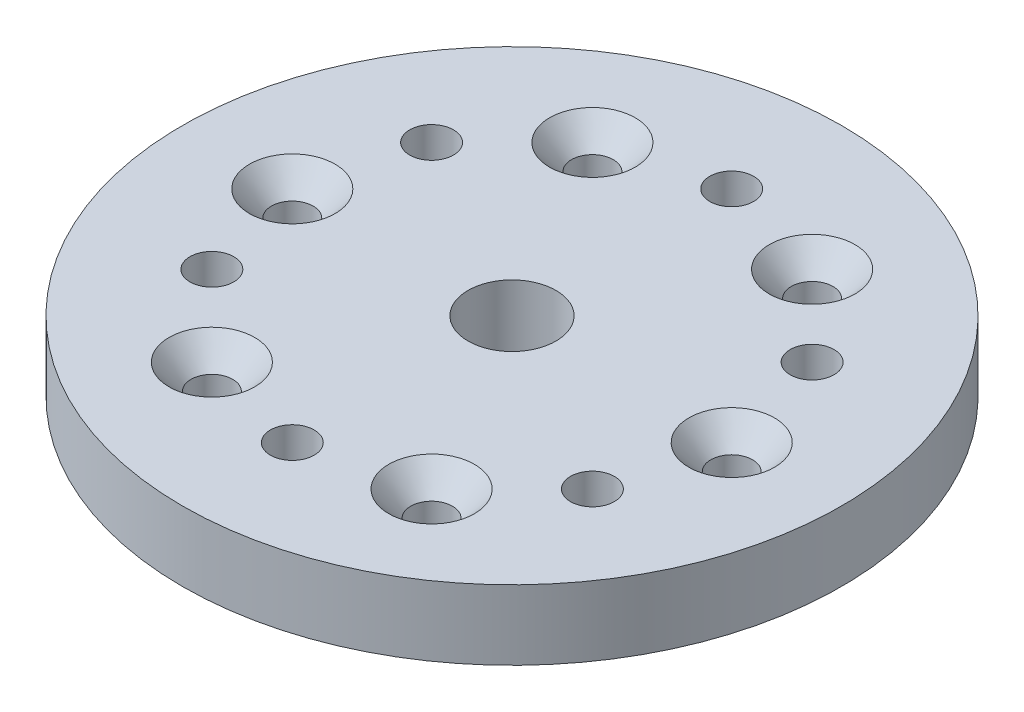
ISO-10303-21;
HEADER;
FILE_DESCRIPTION(('STEP AP214'),'2;1');
FILE_NAME('part.step','',(''),(''),'','','');
FILE_SCHEMA(('AUTOMOTIVE_DESIGN { 1 0 10303 214 1 1 1 1 }'));
ENDSEC;
DATA;
#1=APPLICATION_CONTEXT('core data for automotive mechanical design processes');
#2=APPLICATION_PROTOCOL_DEFINITION('international standard','automotive_design',2000,#1);
#3=PRODUCT_CONTEXT('',#1,'mechanical');
#4=PRODUCT('Part','Part','',(#3));
#5=PRODUCT_RELATED_PRODUCT_CATEGORY('part','',(#4));
#6=PRODUCT_DEFINITION_FORMATION('','',#4);
#7=PRODUCT_DEFINITION_CONTEXT('part definition',#1,'design');
#8=PRODUCT_DEFINITION('design','',#6,#7);
#9=PRODUCT_DEFINITION_SHAPE('','',#8);
#10=(LENGTH_UNIT() NAMED_UNIT(*) SI_UNIT(.MILLI.,.METRE.));
#11=(NAMED_UNIT(*) PLANE_ANGLE_UNIT() SI_UNIT($,.RADIAN.));
#12=(NAMED_UNIT(*) SI_UNIT($,.STERADIAN.) SOLID_ANGLE_UNIT());
#13=UNCERTAINTY_MEASURE_WITH_UNIT(LENGTH_MEASURE(1.E-05),#10,'distance_accuracy_value','');
#14=(GEOMETRIC_REPRESENTATION_CONTEXT(3) GLOBAL_UNCERTAINTY_ASSIGNED_CONTEXT((#13)) GLOBAL_UNIT_ASSIGNED_CONTEXT((#10,
#11,#12)) REPRESENTATION_CONTEXT('',''));
#15=CARTESIAN_POINT('',(0.,0.,0.));
#16=DIRECTION('',(0.,0.,1.));
#17=DIRECTION('',(1.,0.,0.));
#18=AXIS2_PLACEMENT_3D('',#15,#16,#17);
#19=CARTESIAN_POINT('',(0.,6.35,0.));
#20=DIRECTION('',(0.,1.,0.));
#21=DIRECTION('',(0.,0.,1.));
#22=AXIS2_PLACEMENT_3D('',#19,#20,#21);
#23=PLANE('',#22);
#24=CARTESIAN_POINT('',(-10.,6.35,-17.3205080756888));
#25=DIRECTION('',(0.,1.,0.));
#26=DIRECTION('',(0.,0.,1.));
#27=AXIS2_PLACEMENT_3D('',#24,#25,#26);
#28=CIRCLE('',#27,3.89890000002972);
#29=CARTESIAN_POINT('',(-10.,6.35,-13.4216080756591));
#30=VERTEX_POINT('',#29);
#31=EDGE_CURVE('E54',#30,#30,#28,.F.);
#32=ORIENTED_EDGE('',*,*,#31,.T.);
#33=EDGE_LOOP('',(#32));
#34=FACE_BOUND('',#33,.T.);
#35=CARTESIAN_POINT('',(-20.,6.35,0.));
#36=DIRECTION('',(0.,1.,0.));
#37=DIRECTION('',(0.,0.,1.));
#38=AXIS2_PLACEMENT_3D('',#35,#36,#37);
#39=CIRCLE('',#38,3.89890000002971);
#40=CARTESIAN_POINT('',(-20.,6.35,3.89890000002971));
#41=VERTEX_POINT('',#40);
#42=EDGE_CURVE('E57',#41,#41,#39,.F.);
#43=ORIENTED_EDGE('',*,*,#42,.T.);
#44=EDGE_LOOP('',(#43));
#45=FACE_BOUND('',#44,.T.);
#46=CARTESIAN_POINT('',(-10.,6.35,17.3205080756888));
#47=DIRECTION('',(0.,1.,0.));
#48=DIRECTION('',(0.,0.,1.));
#49=AXIS2_PLACEMENT_3D('',#46,#47,#48);
#50=CIRCLE('',#49,3.8989000000297);
#51=CARTESIAN_POINT('',(-10.,6.35,21.2194080757185));
#52=VERTEX_POINT('',#51);
#53=EDGE_CURVE('E60',#52,#52,#50,.F.);
#54=ORIENTED_EDGE('',*,*,#53,.T.);
#55=EDGE_LOOP('',(#54));
#56=FACE_BOUND('',#55,.T.);
#57=CARTESIAN_POINT('',(10.,6.35,17.3205080756888));
#58=DIRECTION('',(0.,1.,0.));
#59=DIRECTION('',(0.,0.,1.));
#60=AXIS2_PLACEMENT_3D('',#57,#58,#59);
#61=CIRCLE('',#60,3.8989000000297);
#62=CARTESIAN_POINT('',(10.,6.35,21.2194080757185));
#63=VERTEX_POINT('',#62);
#64=EDGE_CURVE('E63',#63,#63,#61,.F.);
#65=ORIENTED_EDGE('',*,*,#64,.T.);
#66=EDGE_LOOP('',(#65));
#67=FACE_BOUND('',#66,.T.);
#68=CARTESIAN_POINT('',(20.,6.35,0.));
#69=DIRECTION('',(0.,1.,0.));
#70=DIRECTION('',(0.,0.,1.));
#71=AXIS2_PLACEMENT_3D('',#68,#69,#70);
#72=CIRCLE('',#71,3.89890000002971);
#73=CARTESIAN_POINT('',(20.,6.35,3.89890000002971));
#74=VERTEX_POINT('',#73);
#75=EDGE_CURVE('E66',#74,#74,#72,.F.);
#76=ORIENTED_EDGE('',*,*,#75,.T.);
#77=EDGE_LOOP('',(#76));
#78=FACE_BOUND('',#77,.T.);
#79=CARTESIAN_POINT('',(10.,6.35,-17.3205080756888));
#80=DIRECTION('',(0.,1.,0.));
#81=DIRECTION('',(0.,0.,1.));
#82=AXIS2_PLACEMENT_3D('',#79,#80,#81);
#83=CIRCLE('',#82,3.89890000002972);
#84=CARTESIAN_POINT('',(10.,6.35,-13.4216080756591));
#85=VERTEX_POINT('',#84);
#86=EDGE_CURVE('E69',#85,#85,#83,.F.);
#87=ORIENTED_EDGE('',*,*,#86,.T.);
#88=EDGE_LOOP('',(#87));
#89=FACE_BOUND('',#88,.T.);
#90=CARTESIAN_POINT('',(-17.3205080756888,6.35,9.99999999999999));
#91=DIRECTION('',(0.,1.,0.));
#92=DIRECTION('',(0.,0.,1.));
#93=AXIS2_PLACEMENT_3D('',#90,#91,#92);
#94=CIRCLE('',#93,1.9939);
#95=CARTESIAN_POINT('',(-17.3205080756888,6.35,11.9939));
#96=VERTEX_POINT('',#95);
#97=EDGE_CURVE('E127',#96,#96,#94,.T.);
#98=ORIENTED_EDGE('',*,*,#97,.F.);
#99=EDGE_LOOP('',(#98));
#100=FACE_BOUND('',#99,.T.);
#101=CARTESIAN_POINT('',(17.3205080756888,6.35,10.));
#102=DIRECTION('',(0.,1.,0.));
#103=DIRECTION('',(0.,0.,1.));
#104=AXIS2_PLACEMENT_3D('',#101,#102,#103);
#105=CIRCLE('',#104,1.9939);
#106=CARTESIAN_POINT('',(17.3205080756888,6.35,11.9939));
#107=VERTEX_POINT('',#106);
#108=EDGE_CURVE('E115',#107,#107,#105,.T.);
#109=ORIENTED_EDGE('',*,*,#108,.F.);
#110=EDGE_LOOP('',(#109));
#111=FACE_BOUND('',#110,.T.);
#112=CARTESIAN_POINT('',(0.,6.35,0.));
#113=DIRECTION('',(0.,1.,0.));
#114=DIRECTION('',(0.,0.,1.));
#115=AXIS2_PLACEMENT_3D('',#112,#113,#114);
#116=CIRCLE('',#115,4.);
#117=CARTESIAN_POINT('',(0.,6.35,4.));
#118=VERTEX_POINT('',#117);
#119=EDGE_CURVE('E105',#118,#118,#116,.T.);
#120=ORIENTED_EDGE('',*,*,#119,.F.);
#121=EDGE_LOOP('',(#120));
#122=FACE_BOUND('',#121,.T.);
#123=CARTESIAN_POINT('',(0.,6.35,-20.));
#124=DIRECTION('',(0.,1.,0.));
#125=DIRECTION('',(0.,0.,1.));
#126=AXIS2_PLACEMENT_3D('',#123,#124,#125);
#127=CIRCLE('',#126,1.9939);
#128=CARTESIAN_POINT('',(0.,6.35,-18.0061));
#129=VERTEX_POINT('',#128);
#130=EDGE_CURVE('E84',#129,#129,#127,.T.);
#131=ORIENTED_EDGE('',*,*,#130,.F.);
#132=EDGE_LOOP('',(#131));
#133=FACE_BOUND('',#132,.T.);
#134=CARTESIAN_POINT('',(0.,6.35,0.));
#135=DIRECTION('',(0.,1.,0.));
#136=DIRECTION('',(0.,0.,1.));
#137=AXIS2_PLACEMENT_3D('',#134,#135,#136);
#138=CIRCLE('',#137,30.);
#139=CARTESIAN_POINT('',(0.,6.35,30.));
#140=VERTEX_POINT('',#139);
#141=EDGE_CURVE('E75',#140,#140,#138,.T.);
#142=ORIENTED_EDGE('',*,*,#141,.T.);
#143=EDGE_LOOP('',(#142));
#144=FACE_BOUND('',#143,.T.);
#145=CARTESIAN_POINT('',(17.3205080756888,6.35,-9.99999999999998));
#146=DIRECTION('',(0.,1.,0.));
#147=DIRECTION('',(0.,0.,1.));
#148=AXIS2_PLACEMENT_3D('',#145,#146,#147);
#149=CIRCLE('',#148,1.9939);
#150=CARTESIAN_POINT('',(17.3205080756888,6.35,-8.00609999999998));
#151=VERTEX_POINT('',#150);
#152=EDGE_CURVE('E109',#151,#151,#149,.T.);
#153=ORIENTED_EDGE('',*,*,#152,.F.);
#154=EDGE_LOOP('',(#153));
#155=FACE_BOUND('',#154,.T.);
#156=CARTESIAN_POINT('',(0.,6.35,20.));
#157=DIRECTION('',(0.,1.,0.));
#158=DIRECTION('',(0.,0.,1.));
#159=AXIS2_PLACEMENT_3D('',#156,#157,#158);
#160=CIRCLE('',#159,1.9939);
#161=CARTESIAN_POINT('',(0.,6.35,21.9939));
#162=VERTEX_POINT('',#161);
#163=EDGE_CURVE('E121',#162,#162,#160,.T.);
#164=ORIENTED_EDGE('',*,*,#163,.F.);
#165=EDGE_LOOP('',(#164));
#166=FACE_BOUND('',#165,.T.);
#167=CARTESIAN_POINT('',(-17.3205080756888,6.35,-10.));
#168=DIRECTION('',(0.,1.,0.));
#169=DIRECTION('',(0.,0.,1.));
#170=AXIS2_PLACEMENT_3D('',#167,#168,#169);
#171=CIRCLE('',#170,1.9939);
#172=CARTESIAN_POINT('',(-17.3205080756888,6.35,-8.0061));
#173=VERTEX_POINT('',#172);
#174=EDGE_CURVE('E133',#173,#173,#171,.T.);
#175=ORIENTED_EDGE('',*,*,#174,.F.);
#176=EDGE_LOOP('',(#175));
#177=FACE_BOUND('',#176,.T.);
#178=ADVANCED_FACE('F31',(#34,#45,#56,#67,#78,#89,#100,#111,#122,#133,#144,#155,#166,#177),#23,.T.);
#179=CARTESIAN_POINT('',(0.,0.,0.));
#180=DIRECTION('',(0.,1.,0.));
#181=DIRECTION('',(0.,0.,1.));
#182=AXIS2_PLACEMENT_3D('',#179,#180,#181);
#183=PLANE('',#182);
#184=CARTESIAN_POINT('',(0.,0.,0.));
#185=DIRECTION('',(0.,1.,0.));
#186=DIRECTION('',(0.,0.,1.));
#187=AXIS2_PLACEMENT_3D('',#184,#185,#186);
#188=CIRCLE('',#187,30.);
#189=CARTESIAN_POINT('',(0.,0.,30.));
#190=VERTEX_POINT('',#189);
#191=EDGE_CURVE('E76',#190,#190,#188,.T.);
#192=ORIENTED_EDGE('',*,*,#191,.F.);
#193=EDGE_LOOP('',(#192));
#194=FACE_BOUND('',#193,.T.);
#195=CARTESIAN_POINT('',(20.,0.,0.));
#196=DIRECTION('',(0.,1.,0.));
#197=DIRECTION('',(0.,0.,1.));
#198=AXIS2_PLACEMENT_3D('',#195,#196,#197);
#199=CIRCLE('',#198,1.89865);
#200=CARTESIAN_POINT('',(20.,0.,1.89865));
#201=VERTEX_POINT('',#200);
#202=EDGE_CURVE('E79',#201,#201,#199,.T.);
#203=ORIENTED_EDGE('',*,*,#202,.T.);
#204=EDGE_LOOP('',(#203));
#205=FACE_BOUND('',#204,.T.);
#206=CARTESIAN_POINT('',(0.,0.,-20.));
#207=DIRECTION('',(0.,1.,0.));
#208=DIRECTION('',(0.,0.,1.));
#209=AXIS2_PLACEMENT_3D('',#206,#207,#208);
#210=CIRCLE('',#209,1.9939);
#211=CARTESIAN_POINT('',(0.,0.,-18.0061));
#212=VERTEX_POINT('',#211);
#213=EDGE_CURVE('E85',#212,#212,#210,.T.);
#214=ORIENTED_EDGE('',*,*,#213,.T.);
#215=EDGE_LOOP('',(#214));
#216=FACE_BOUND('',#215,.T.);
#217=CARTESIAN_POINT('',(10.,0.,17.3205080756888));
#218=DIRECTION('',(0.,1.,0.));
#219=DIRECTION('',(0.,0.,1.));
#220=AXIS2_PLACEMENT_3D('',#217,#218,#219);
#221=CIRCLE('',#220,1.89865);
#222=CARTESIAN_POINT('',(10.,0.,19.2191580756888));
#223=VERTEX_POINT('',#222);
#224=EDGE_CURVE('E88',#223,#223,#221,.T.);
#225=ORIENTED_EDGE('',*,*,#224,.T.);
#226=EDGE_LOOP('',(#225));
#227=FACE_BOUND('',#226,.T.);
#228=CARTESIAN_POINT('',(-10.,0.,17.3205080756888));
#229=DIRECTION('',(0.,1.,0.));
#230=DIRECTION('',(0.,0.,1.));
#231=AXIS2_PLACEMENT_3D('',#228,#229,#230);
#232=CIRCLE('',#231,1.89865);
#233=CARTESIAN_POINT('',(-10.,0.,19.2191580756888));
#234=VERTEX_POINT('',#233);
#235=EDGE_CURVE('E93',#234,#234,#232,.T.);
#236=ORIENTED_EDGE('',*,*,#235,.T.);
#237=EDGE_LOOP('',(#236));
#238=FACE_BOUND('',#237,.T.);
#239=CARTESIAN_POINT('',(-20.,0.,0.));
#240=DIRECTION('',(0.,1.,0.));
#241=DIRECTION('',(0.,0.,1.));
#242=AXIS2_PLACEMENT_3D('',#239,#240,#241);
#243=CIRCLE('',#242,1.89865);
#244=CARTESIAN_POINT('',(-20.,0.,1.89865));
#245=VERTEX_POINT('',#244);
#246=EDGE_CURVE('E96',#245,#245,#243,.T.);
#247=ORIENTED_EDGE('',*,*,#246,.T.);
#248=EDGE_LOOP('',(#247));
#249=FACE_BOUND('',#248,.T.);
#250=CARTESIAN_POINT('',(-10.,0.,-17.3205080756888));
#251=DIRECTION('',(0.,1.,0.));
#252=DIRECTION('',(0.,0.,1.));
#253=AXIS2_PLACEMENT_3D('',#250,#251,#252);
#254=CIRCLE('',#253,1.89865);
#255=CARTESIAN_POINT('',(-10.,0.,-15.4218580756888));
#256=VERTEX_POINT('',#255);
#257=EDGE_CURVE('E99',#256,#256,#254,.T.);
#258=ORIENTED_EDGE('',*,*,#257,.T.);
#259=EDGE_LOOP('',(#258));
#260=FACE_BOUND('',#259,.T.);
#261=CARTESIAN_POINT('',(10.,0.,-17.3205080756888));
#262=DIRECTION('',(0.,1.,0.));
#263=DIRECTION('',(0.,0.,1.));
#264=AXIS2_PLACEMENT_3D('',#261,#262,#263);
#265=CIRCLE('',#264,1.89865);
#266=CARTESIAN_POINT('',(10.,0.,-15.4218580756888));
#267=VERTEX_POINT('',#266);
#268=EDGE_CURVE('E102',#267,#267,#265,.T.);
#269=ORIENTED_EDGE('',*,*,#268,.T.);
#270=EDGE_LOOP('',(#269));
#271=FACE_BOUND('',#270,.T.);
#272=CARTESIAN_POINT('',(0.,0.,0.));
#273=DIRECTION('',(0.,1.,0.));
#274=DIRECTION('',(0.,0.,1.));
#275=AXIS2_PLACEMENT_3D('',#272,#273,#274);
#276=CIRCLE('',#275,4.);
#277=CARTESIAN_POINT('',(0.,0.,4.));
#278=VERTEX_POINT('',#277);
#279=EDGE_CURVE('E106',#278,#278,#276,.T.);
#280=ORIENTED_EDGE('',*,*,#279,.T.);
#281=EDGE_LOOP('',(#280));
#282=FACE_BOUND('',#281,.T.);
#283=CARTESIAN_POINT('',(17.3205080756888,0.,-9.99999999999998));
#284=DIRECTION('',(0.,1.,0.));
#285=DIRECTION('',(0.,0.,1.));
#286=AXIS2_PLACEMENT_3D('',#283,#284,#285);
#287=CIRCLE('',#286,1.9939);
#288=CARTESIAN_POINT('',(17.3205080756888,0.,-8.00609999999998));
#289=VERTEX_POINT('',#288);
#290=EDGE_CURVE('E112',#289,#289,#287,.T.);
#291=ORIENTED_EDGE('',*,*,#290,.T.);
#292=EDGE_LOOP('',(#291));
#293=FACE_BOUND('',#292,.T.);
#294=CARTESIAN_POINT('',(17.3205080756888,0.,10.));
#295=DIRECTION('',(0.,1.,0.));
#296=DIRECTION('',(0.,0.,1.));
#297=AXIS2_PLACEMENT_3D('',#294,#295,#296);
#298=CIRCLE('',#297,1.9939);
#299=CARTESIAN_POINT('',(17.3205080756888,0.,11.9939));
#300=VERTEX_POINT('',#299);
#301=EDGE_CURVE('E118',#300,#300,#298,.T.);
#302=ORIENTED_EDGE('',*,*,#301,.T.);
#303=EDGE_LOOP('',(#302));
#304=FACE_BOUND('',#303,.T.);
#305=CARTESIAN_POINT('',(0.,0.,20.));
#306=DIRECTION('',(0.,1.,0.));
#307=DIRECTION('',(0.,0.,1.));
#308=AXIS2_PLACEMENT_3D('',#305,#306,#307);
#309=CIRCLE('',#308,1.9939);
#310=CARTESIAN_POINT('',(0.,0.,21.9939));
#311=VERTEX_POINT('',#310);
#312=EDGE_CURVE('E124',#311,#311,#309,.T.);
#313=ORIENTED_EDGE('',*,*,#312,.T.);
#314=EDGE_LOOP('',(#313));
#315=FACE_BOUND('',#314,.T.);
#316=CARTESIAN_POINT('',(-17.3205080756888,0.,9.99999999999999));
#317=DIRECTION('',(0.,1.,0.));
#318=DIRECTION('',(0.,0.,1.));
#319=AXIS2_PLACEMENT_3D('',#316,#317,#318);
#320=CIRCLE('',#319,1.9939);
#321=CARTESIAN_POINT('',(-17.3205080756888,0.,11.9939));
#322=VERTEX_POINT('',#321);
#323=EDGE_CURVE('E130',#322,#322,#320,.T.);
#324=ORIENTED_EDGE('',*,*,#323,.T.);
#325=EDGE_LOOP('',(#324));
#326=FACE_BOUND('',#325,.T.);
#327=CARTESIAN_POINT('',(-17.3205080756888,0.,-10.));
#328=DIRECTION('',(0.,1.,0.));
#329=DIRECTION('',(0.,0.,1.));
#330=AXIS2_PLACEMENT_3D('',#327,#328,#329);
#331=CIRCLE('',#330,1.9939);
#332=CARTESIAN_POINT('',(-17.3205080756888,0.,-8.0061));
#333=VERTEX_POINT('',#332);
#334=EDGE_CURVE('E136',#333,#333,#331,.T.);
#335=ORIENTED_EDGE('',*,*,#334,.T.);
#336=EDGE_LOOP('',(#335));
#337=FACE_BOUND('',#336,.T.);
#338=ADVANCED_FACE('F146',(#194,#205,#216,#227,#238,#249,#260,#271,#282,#293,#304,#315,#326,
#337),#183,.F.);
#339=CARTESIAN_POINT('',(0.,6.35,0.));
#340=DIRECTION('',(0.,-1.,0.));
#341=DIRECTION('',(0.,0.,-1.));
#342=AXIS2_PLACEMENT_3D('',#339,#340,#341);
#343=CYLINDRICAL_SURFACE('',#342,30.);
#344=ORIENTED_EDGE('',*,*,#141,.F.);
#345=EDGE_LOOP('',(#344));
#346=FACE_BOUND('',#345,.T.);
#347=ORIENTED_EDGE('',*,*,#191,.T.);
#348=EDGE_LOOP('',(#347));
#349=FACE_BOUND('',#348,.T.);
#350=ADVANCED_FACE('F152',(#346,#349),#343,.T.);
#351=CARTESIAN_POINT('',(20.,6.35,0.));
#352=DIRECTION('',(0.,-1.,0.));
#353=DIRECTION('',(0.,0.,-1.));
#354=AXIS2_PLACEMENT_3D('',#351,#352,#353);
#355=CYLINDRICAL_SURFACE('',#354,1.89865);
#356=CARTESIAN_POINT('',(20.,4.04897559342199,0.));
#357=DIRECTION('',(0.,1.,0.));
#358=DIRECTION('',(0.,0.,1.));
#359=AXIS2_PLACEMENT_3D('',#356,#357,#358);
#360=CIRCLE('',#359,1.89865);
#361=CARTESIAN_POINT('',(20.,4.04897559342199,1.89865));
#362=VERTEX_POINT('',#361);
#363=EDGE_CURVE('E38',#362,#362,#360,.T.);
#364=ORIENTED_EDGE('',*,*,#363,.T.);
#365=EDGE_LOOP('',(#364));
#366=FACE_BOUND('',#365,.T.);
#367=ORIENTED_EDGE('',*,*,#202,.F.);
#368=EDGE_LOOP('',(#367));
#369=FACE_BOUND('',#368,.T.);
#370=ADVANCED_FACE('F157',(#366,#369),#355,.F.);
#371=CARTESIAN_POINT('',(0.,6.35,-20.));
#372=DIRECTION('',(0.,-1.,0.));
#373=DIRECTION('',(0.,0.,-1.));
#374=AXIS2_PLACEMENT_3D('',#371,#372,#373);
#375=CYLINDRICAL_SURFACE('',#374,1.9939);
#376=ORIENTED_EDGE('',*,*,#130,.T.);
#377=EDGE_LOOP('',(#376));
#378=FACE_BOUND('',#377,.T.);
#379=ORIENTED_EDGE('',*,*,#213,.F.);
#380=EDGE_LOOP('',(#379));
#381=FACE_BOUND('',#380,.T.);
#382=ADVANCED_FACE('F253',(#378,#381),#375,.F.);
#383=CARTESIAN_POINT('',(10.,6.35,17.3205080756888));
#384=DIRECTION('',(0.,-1.,0.));
#385=DIRECTION('',(0.,0.,-1.));
#386=AXIS2_PLACEMENT_3D('',#383,#384,#385);
#387=CYLINDRICAL_SURFACE('',#386,1.89865);
#388=CARTESIAN_POINT('',(10.,4.04897559342199,17.3205080756888));
#389=DIRECTION('',(0.,1.,0.));
#390=DIRECTION('',(0.,0.,1.));
#391=AXIS2_PLACEMENT_3D('',#388,#389,#390);
#392=CIRCLE('',#391,1.89865);
#393=CARTESIAN_POINT('',(10.,4.04897559342199,19.2191580756888));
#394=VERTEX_POINT('',#393);
#395=EDGE_CURVE('E42',#394,#394,#392,.T.);
#396=ORIENTED_EDGE('',*,*,#395,.T.);
#397=EDGE_LOOP('',(#396));
#398=FACE_BOUND('',#397,.T.);
#399=ORIENTED_EDGE('',*,*,#224,.F.);
#400=EDGE_LOOP('',(#399));
#401=FACE_BOUND('',#400,.T.);
#402=ADVANCED_FACE('F250',(#398,#401),#387,.F.);
#403=CARTESIAN_POINT('',(-10.,6.35,17.3205080756888));
#404=DIRECTION('',(0.,-1.,0.));
#405=DIRECTION('',(0.,0.,-1.));
#406=AXIS2_PLACEMENT_3D('',#403,#404,#405);
#407=CYLINDRICAL_SURFACE('',#406,1.89865);
#408=CARTESIAN_POINT('',(-10.,4.04897559342199,17.3205080756888));
#409=DIRECTION('',(0.,1.,0.));
#410=DIRECTION('',(0.,0.,1.));
#411=AXIS2_PLACEMENT_3D('',#408,#409,#410);
#412=CIRCLE('',#411,1.89865);
#413=CARTESIAN_POINT('',(-10.,4.04897559342199,19.2191580756888));
#414=VERTEX_POINT('',#413);
#415=EDGE_CURVE('E46',#414,#414,#412,.T.);
#416=ORIENTED_EDGE('',*,*,#415,.T.);
#417=EDGE_LOOP('',(#416));
#418=FACE_BOUND('',#417,.T.);
#419=ORIENTED_EDGE('',*,*,#235,.F.);
#420=EDGE_LOOP('',(#419));
#421=FACE_BOUND('',#420,.T.);
#422=ADVANCED_FACE('F246',(#418,#421),#407,.F.);
#423=CARTESIAN_POINT('',(-20.,6.35,0.));
#424=DIRECTION('',(0.,-1.,0.));
#425=DIRECTION('',(0.,0.,-1.));
#426=AXIS2_PLACEMENT_3D('',#423,#424,#425);
#427=CYLINDRICAL_SURFACE('',#426,1.89865);
#428=CARTESIAN_POINT('',(-20.,4.04897559342199,0.));
#429=DIRECTION('',(0.,1.,0.));
#430=DIRECTION('',(0.,0.,1.));
#431=AXIS2_PLACEMENT_3D('',#428,#429,#430);
#432=CIRCLE('',#431,1.89865);
#433=CARTESIAN_POINT('',(-20.,4.04897559342199,1.89865));
#434=VERTEX_POINT('',#433);
#435=EDGE_CURVE('E51',#434,#434,#432,.T.);
#436=ORIENTED_EDGE('',*,*,#435,.T.);
#437=EDGE_LOOP('',(#436));
#438=FACE_BOUND('',#437,.T.);
#439=ORIENTED_EDGE('',*,*,#246,.F.);
#440=EDGE_LOOP('',(#439));
#441=FACE_BOUND('',#440,.T.);
#442=ADVANCED_FACE('F242',(#438,#441),#427,.F.);
#443=CARTESIAN_POINT('',(-10.,6.35,-17.3205080756888));
#444=DIRECTION('',(0.,-1.,0.));
#445=DIRECTION('',(0.,0.,-1.));
#446=AXIS2_PLACEMENT_3D('',#443,#444,#445);
#447=CYLINDRICAL_SURFACE('',#446,1.89865);
#448=CARTESIAN_POINT('',(-10.,4.04897559342199,-17.3205080756888));
#449=DIRECTION('',(0.,1.,0.));
#450=DIRECTION('',(0.,0.,1.));
#451=AXIS2_PLACEMENT_3D('',#448,#449,#450);
#452=CIRCLE('',#451,1.89865);
#453=CARTESIAN_POINT('',(-10.,4.04897559342199,-15.4218580756888));
#454=VERTEX_POINT('',#453);
#455=EDGE_CURVE('E72',#454,#454,#452,.T.);
#456=ORIENTED_EDGE('',*,*,#455,.T.);
#457=EDGE_LOOP('',(#456));
#458=FACE_BOUND('',#457,.T.);
#459=ORIENTED_EDGE('',*,*,#257,.F.);
#460=EDGE_LOOP('',(#459));
#461=FACE_BOUND('',#460,.T.);
#462=ADVANCED_FACE('F239',(#458,#461),#447,.F.);
#463=CARTESIAN_POINT('',(10.,6.35,-17.3205080756888));
#464=DIRECTION('',(0.,-1.,0.));
#465=DIRECTION('',(0.,0.,-1.));
#466=AXIS2_PLACEMENT_3D('',#463,#464,#465);
#467=CYLINDRICAL_SURFACE('',#466,1.89865);
#468=CARTESIAN_POINT('',(10.,4.04897559342199,-17.3205080756888));
#469=DIRECTION('',(0.,1.,0.));
#470=DIRECTION('',(0.,0.,1.));
#471=AXIS2_PLACEMENT_3D('',#468,#469,#470);
#472=CIRCLE('',#471,1.89865);
#473=CARTESIAN_POINT('',(10.,4.04897559342199,-15.4218580756888));
#474=VERTEX_POINT('',#473);
#475=EDGE_CURVE('E10',#474,#474,#472,.T.);
#476=ORIENTED_EDGE('',*,*,#475,.T.);
#477=EDGE_LOOP('',(#476));
#478=FACE_BOUND('',#477,.T.);
#479=ORIENTED_EDGE('',*,*,#268,.F.);
#480=EDGE_LOOP('',(#479));
#481=FACE_BOUND('',#480,.T.);
#482=ADVANCED_FACE('F235',(#478,#481),#467,.F.);
#483=CARTESIAN_POINT('',(0.,6.35,0.));
#484=DIRECTION('',(0.,-1.,0.));
#485=DIRECTION('',(0.,0.,-1.));
#486=AXIS2_PLACEMENT_3D('',#483,#484,#485);
#487=CYLINDRICAL_SURFACE('',#486,4.);
#488=ORIENTED_EDGE('',*,*,#119,.T.);
#489=EDGE_LOOP('',(#488));
#490=FACE_BOUND('',#489,.T.);
#491=ORIENTED_EDGE('',*,*,#279,.F.);
#492=EDGE_LOOP('',(#491));
#493=FACE_BOUND('',#492,.T.);
#494=ADVANCED_FACE('F231',(#490,#493),#487,.F.);
#495=CARTESIAN_POINT('',(17.3205080756888,6.35,-9.99999999999998));
#496=DIRECTION('',(0.,-1.,0.));
#497=DIRECTION('',(0.,0.,-1.));
#498=AXIS2_PLACEMENT_3D('',#495,#496,#497);
#499=CYLINDRICAL_SURFACE('',#498,1.9939);
#500=ORIENTED_EDGE('',*,*,#152,.T.);
#501=EDGE_LOOP('',(#500));
#502=FACE_BOUND('',#501,.T.);
#503=ORIENTED_EDGE('',*,*,#290,.F.);
#504=EDGE_LOOP('',(#503));
#505=FACE_BOUND('',#504,.T.);
#506=ADVANCED_FACE('F227',(#502,#505),#499,.F.);
#507=CARTESIAN_POINT('',(17.3205080756888,6.35,10.));
#508=DIRECTION('',(0.,-1.,0.));
#509=DIRECTION('',(0.,0.,-1.));
#510=AXIS2_PLACEMENT_3D('',#507,#508,#509);
#511=CYLINDRICAL_SURFACE('',#510,1.9939);
#512=ORIENTED_EDGE('',*,*,#108,.T.);
#513=EDGE_LOOP('',(#512));
#514=FACE_BOUND('',#513,.T.);
#515=ORIENTED_EDGE('',*,*,#301,.F.);
#516=EDGE_LOOP('',(#515));
#517=FACE_BOUND('',#516,.T.);
#518=ADVANCED_FACE('F209',(#514,#517),#511,.F.);
#519=CARTESIAN_POINT('',(0.,6.35,20.));
#520=DIRECTION('',(0.,-1.,0.));
#521=DIRECTION('',(0.,0.,-1.));
#522=AXIS2_PLACEMENT_3D('',#519,#520,#521);
#523=CYLINDRICAL_SURFACE('',#522,1.9939);
#524=ORIENTED_EDGE('',*,*,#163,.T.);
#525=EDGE_LOOP('',(#524));
#526=FACE_BOUND('',#525,.T.);
#527=ORIENTED_EDGE('',*,*,#312,.F.);
#528=EDGE_LOOP('',(#527));
#529=FACE_BOUND('',#528,.T.);
#530=ADVANCED_FACE('F205',(#526,#529),#523,.F.);
#531=CARTESIAN_POINT('',(-17.3205080756888,6.35,9.99999999999999));
#532=DIRECTION('',(0.,-1.,0.));
#533=DIRECTION('',(0.,0.,-1.));
#534=AXIS2_PLACEMENT_3D('',#531,#532,#533);
#535=CYLINDRICAL_SURFACE('',#534,1.9939);
#536=ORIENTED_EDGE('',*,*,#97,.T.);
#537=EDGE_LOOP('',(#536));
#538=FACE_BOUND('',#537,.T.);
#539=ORIENTED_EDGE('',*,*,#323,.F.);
#540=EDGE_LOOP('',(#539));
#541=FACE_BOUND('',#540,.T.);
#542=ADVANCED_FACE('F208',(#538,#541),#535,.F.);
#543=CARTESIAN_POINT('',(-17.3205080756888,6.35,-10.));
#544=DIRECTION('',(0.,-1.,0.));
#545=DIRECTION('',(0.,0.,-1.));
#546=AXIS2_PLACEMENT_3D('',#543,#544,#545);
#547=CYLINDRICAL_SURFACE('',#546,1.9939);
#548=ORIENTED_EDGE('',*,*,#174,.T.);
#549=EDGE_LOOP('',(#548));
#550=FACE_BOUND('',#549,.T.);
#551=ORIENTED_EDGE('',*,*,#334,.F.);
#552=EDGE_LOOP('',(#551));
#553=FACE_BOUND('',#552,.T.);
#554=ADVANCED_FACE('F142',(#550,#553),#547,.F.);
#555=CARTESIAN_POINT('',(-10.,4.04897559342199,-17.3205080756888));
#556=DIRECTION('',(0.,1.,0.));
#557=DIRECTION('',(0.,0.,1.));
#558=AXIS2_PLACEMENT_3D('',#555,#556,#557);
#559=CONICAL_SURFACE('',#558,1.89865,0.715584993317676);
#560=ORIENTED_EDGE('',*,*,#31,.F.);
#561=EDGE_LOOP('',(#560));
#562=FACE_BOUND('',#561,.T.);
#563=ORIENTED_EDGE('',*,*,#455,.F.);
#564=EDGE_LOOP('',(#563));
#565=FACE_BOUND('',#564,.T.);
#566=ADVANCED_FACE('F163',(#562,#565),#559,.F.);
#567=CARTESIAN_POINT('',(-20.,4.04897559342199,0.));
#568=DIRECTION('',(0.,1.,0.));
#569=DIRECTION('',(0.,0.,1.));
#570=AXIS2_PLACEMENT_3D('',#567,#568,#569);
#571=CONICAL_SURFACE('',#570,1.89865,0.715584993317673);
#572=ORIENTED_EDGE('',*,*,#42,.F.);
#573=EDGE_LOOP('',(#572));
#574=FACE_BOUND('',#573,.T.);
#575=ORIENTED_EDGE('',*,*,#435,.F.);
#576=EDGE_LOOP('',(#575));
#577=FACE_BOUND('',#576,.T.);
#578=ADVANCED_FACE('F166',(#574,#577),#571,.F.);
#579=CARTESIAN_POINT('',(-10.,4.04897559342199,17.3205080756888));
#580=DIRECTION('',(0.,1.,0.));
#581=DIRECTION('',(0.,0.,1.));
#582=AXIS2_PLACEMENT_3D('',#579,#580,#581);
#583=CONICAL_SURFACE('',#582,1.89865,0.71558499331767);
#584=ORIENTED_EDGE('',*,*,#53,.F.);
#585=EDGE_LOOP('',(#584));
#586=FACE_BOUND('',#585,.T.);
#587=ORIENTED_EDGE('',*,*,#415,.F.);
#588=EDGE_LOOP('',(#587));
#589=FACE_BOUND('',#588,.T.);
#590=ADVANCED_FACE('F170',(#586,#589),#583,.F.);
#591=CARTESIAN_POINT('',(10.,4.04897559342199,17.3205080756888));
#592=DIRECTION('',(0.,1.,0.));
#593=DIRECTION('',(0.,0.,1.));
#594=AXIS2_PLACEMENT_3D('',#591,#592,#593);
#595=CONICAL_SURFACE('',#594,1.89865,0.71558499331767);
#596=ORIENTED_EDGE('',*,*,#64,.F.);
#597=EDGE_LOOP('',(#596));
#598=FACE_BOUND('',#597,.T.);
#599=ORIENTED_EDGE('',*,*,#395,.F.);
#600=EDGE_LOOP('',(#599));
#601=FACE_BOUND('',#600,.T.);
#602=ADVANCED_FACE('F174',(#598,#601),#595,.F.);
#603=CARTESIAN_POINT('',(20.,4.04897559342199,0.));
#604=DIRECTION('',(0.,1.,0.));
#605=DIRECTION('',(0.,0.,1.));
#606=AXIS2_PLACEMENT_3D('',#603,#604,#605);
#607=CONICAL_SURFACE('',#606,1.89865,0.715584993317673);
#608=ORIENTED_EDGE('',*,*,#75,.F.);
#609=EDGE_LOOP('',(#608));
#610=FACE_BOUND('',#609,.T.);
#611=ORIENTED_EDGE('',*,*,#363,.F.);
#612=EDGE_LOOP('',(#611));
#613=FACE_BOUND('',#612,.T.);
#614=ADVANCED_FACE('F177',(#610,#613),#607,.F.);
#615=CARTESIAN_POINT('',(10.,4.04897559342199,-17.3205080756888));
#616=DIRECTION('',(0.,1.,0.));
#617=DIRECTION('',(0.,0.,1.));
#618=AXIS2_PLACEMENT_3D('',#615,#616,#617);
#619=CONICAL_SURFACE('',#618,1.89865,0.715584993317676);
#620=ORIENTED_EDGE('',*,*,#86,.F.);
#621=EDGE_LOOP('',(#620));
#622=FACE_BOUND('',#621,.T.);
#623=ORIENTED_EDGE('',*,*,#475,.F.);
#624=EDGE_LOOP('',(#623));
#625=FACE_BOUND('',#624,.T.);
#626=ADVANCED_FACE('F33',(#622,#625),#619,.F.);
#627=CLOSED_SHELL('',(#178,#338,#350,#370,#382,#402,#422,#442,#462,#482,#494,#506,#518,#530,
#542,#554,#566,#578,#590,#602,#614,#626));
#628=MANIFOLD_SOLID_BREP('B2',#627);
#629=ADVANCED_BREP_SHAPE_REPRESENTATION('',(#18,#628),#14);
#630=SHAPE_DEFINITION_REPRESENTATION(#9,#629);
ENDSEC;
END-ISO-10303-21;
